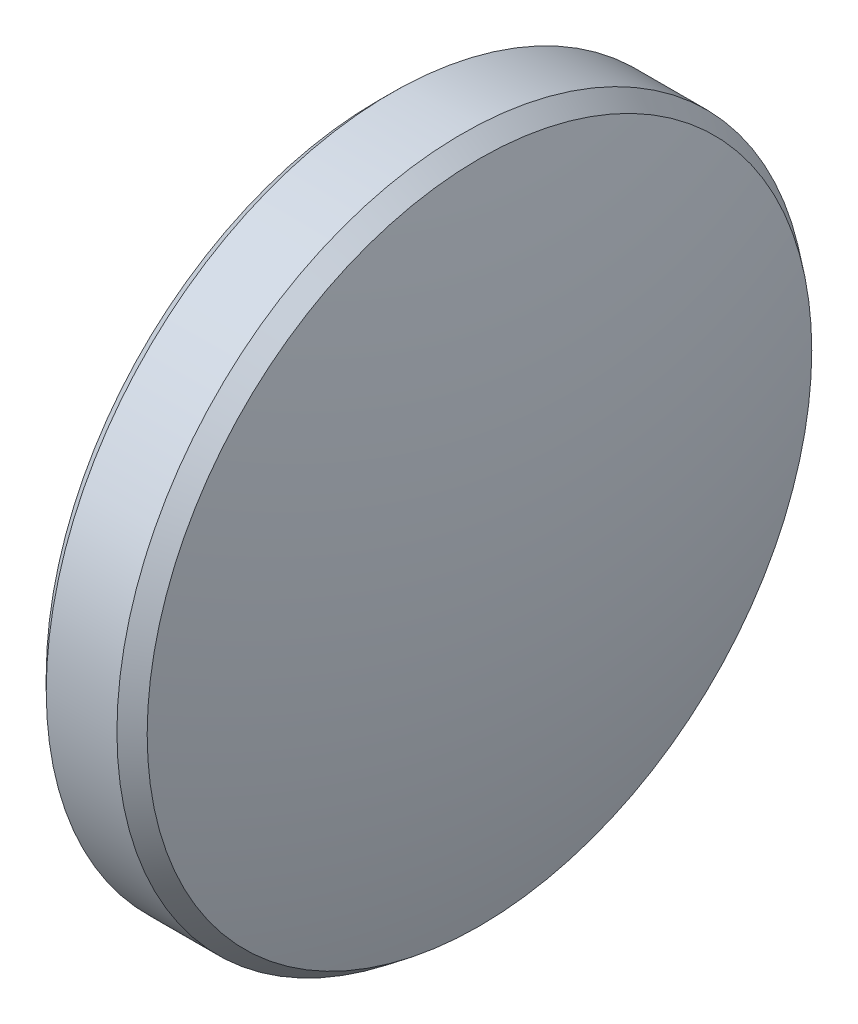
ISO-10303-21;
HEADER;
FILE_DESCRIPTION(('STEP AP214'),'2;1');
FILE_NAME('part.step','',(''),(''),'','','');
FILE_SCHEMA(('AUTOMOTIVE_DESIGN { 1 0 10303 214 1 1 1 1 }'));
ENDSEC;
DATA;
#1=APPLICATION_CONTEXT('core data for automotive mechanical design processes');
#2=APPLICATION_PROTOCOL_DEFINITION('international standard','automotive_design',2000,#1);
#3=PRODUCT_CONTEXT('',#1,'mechanical');
#4=PRODUCT('Part','Part','',(#3));
#5=PRODUCT_RELATED_PRODUCT_CATEGORY('part','',(#4));
#6=PRODUCT_DEFINITION_FORMATION('','',#4);
#7=PRODUCT_DEFINITION_CONTEXT('part definition',#1,'design');
#8=PRODUCT_DEFINITION('design','',#6,#7);
#9=PRODUCT_DEFINITION_SHAPE('','',#8);
#10=(LENGTH_UNIT() NAMED_UNIT(*) SI_UNIT(.MILLI.,.METRE.));
#11=(NAMED_UNIT(*) PLANE_ANGLE_UNIT() SI_UNIT($,.RADIAN.));
#12=(NAMED_UNIT(*) SI_UNIT($,.STERADIAN.) SOLID_ANGLE_UNIT());
#13=UNCERTAINTY_MEASURE_WITH_UNIT(LENGTH_MEASURE(1.E-05),#10,'distance_accuracy_value','');
#14=(GEOMETRIC_REPRESENTATION_CONTEXT(3) GLOBAL_UNCERTAINTY_ASSIGNED_CONTEXT((#13)) GLOBAL_UNIT_ASSIGNED_CONTEXT((#10,
#11,#12)) REPRESENTATION_CONTEXT('',''));
#15=CARTESIAN_POINT('',(0.,0.,0.));
#16=DIRECTION('',(0.,0.,1.));
#17=DIRECTION('',(1.,0.,0.));
#18=AXIS2_PLACEMENT_3D('',#15,#16,#17);
#19=CARTESIAN_POINT('',(-1.35,0.,0.));
#20=DIRECTION('',(1.,0.,0.));
#21=DIRECTION('',(0.,0.,-1.));
#22=AXIS2_PLACEMENT_3D('',#19,#20,#21);
#23=PLANE('',#22);
#24=CARTESIAN_POINT('',(-1.35,0.,0.));
#25=DIRECTION('',(1.,0.,0.));
#26=DIRECTION('',(0.,0.,-1.));
#27=AXIS2_PLACEMENT_3D('',#24,#25,#26);
#28=CIRCLE('',#27,6.1);
#29=CARTESIAN_POINT('',(-1.35,0.,-6.1));
#30=VERTEX_POINT('',#29);
#31=EDGE_CURVE('E10',#30,#30,#28,.F.);
#32=ORIENTED_EDGE('',*,*,#31,.T.);
#33=EDGE_LOOP('',(#32));
#34=FACE_BOUND('',#33,.T.);
#35=ADVANCED_FACE('F15',(#34),#23,.F.);
#36=CARTESIAN_POINT('',(-1.35,0.,0.));
#37=DIRECTION('',(-1.,0.,0.));
#38=DIRECTION('',(0.,0.,1.));
#39=AXIS2_PLACEMENT_3D('',#36,#37,#38);
#40=CYLINDRICAL_SURFACE('',#39,6.35);
#41=CARTESIAN_POINT('',(0.199999999999999,0.,0.));
#42=DIRECTION('',(-1.,0.,0.));
#43=DIRECTION('',(0.,0.,1.));
#44=AXIS2_PLACEMENT_3D('',#41,#42,#43);
#45=CIRCLE('',#44,6.35);
#46=CARTESIAN_POINT('',(0.199999999999999,0.,6.35));
#47=VERTEX_POINT('',#46);
#48=EDGE_CURVE('E55',#47,#47,#45,.T.);
#49=ORIENTED_EDGE('',*,*,#48,.T.);
#50=EDGE_LOOP('',(#49));
#51=FACE_BOUND('',#50,.T.);
#52=CARTESIAN_POINT('',(-1.1,0.,0.));
#53=DIRECTION('',(1.,0.,0.));
#54=DIRECTION('',(0.,0.,-1.));
#55=AXIS2_PLACEMENT_3D('',#52,#53,#54);
#56=CIRCLE('',#55,6.35);
#57=CARTESIAN_POINT('',(-1.1,0.,-6.35));
#58=VERTEX_POINT('',#57);
#59=EDGE_CURVE('E53',#58,#58,#56,.T.);
#60=ORIENTED_EDGE('',*,*,#59,.T.);
#61=EDGE_LOOP('',(#60));
#62=FACE_BOUND('',#61,.T.);
#63=ADVANCED_FACE('F28',(#51,#62),#40,.T.);
#64=CARTESIAN_POINT('',(-21.6499903566923,0.,-0.02106162535796));
#65=DIRECTION('',(0.,-1.,0.));
#66=DIRECTION('',(0.,0.,1.));
#67=AXIS2_PLACEMENT_3D('',#64,#65,#66);
#68=CIRCLE('',#67,23.);
#69=TRIMMED_CURVE('',#68,(PARAMETER_VALUE(-1.56988060382527)),
(PARAMETER_VALUE(1.56988060382527)),.T.,.PARAMETER.);
#70=CARTESIAN_POINT('',(-21.6499903566923,0.,0.));
#71=DIRECTION('',(-1.,0.,0.));
#72=AXIS1_PLACEMENT('',#70,#71);
#73=SURFACE_OF_REVOLUTION('',#69,#72);
#74=CARTESIAN_POINT('',(0.517470524714639,0.,0.));
#75=DIRECTION('',(-1.,0.,0.));
#76=DIRECTION('',(0.,0.,1.));
#77=AXIS2_PLACEMENT_3D('',#74,#75,#76);
#78=CIRCLE('',#77,6.11112216765532);
#79=CARTESIAN_POINT('',(0.517470524714639,0.,6.11112216765532));
#80=VERTEX_POINT('',#79);
#81=EDGE_CURVE('E22',#80,#80,#78,.F.);
#82=ORIENTED_EDGE('',*,*,#81,.T.);
#83=EDGE_LOOP('',(#82));
#84=FACE_BOUND('',#83,.T.);
#85=CARTESIAN_POINT('',(1.35,0.,0.));
#86=VERTEX_POINT('',#85);
#87=VERTEX_LOOP('',#86);
#88=FACE_BOUND('',#87,.T.);
#89=ADVANCED_FACE('F25',(#84,#88),#73,.T.);
#90=CARTESIAN_POINT('',(0.199999999999999,0.,0.));
#91=DIRECTION('',(-1.,0.,0.));
#92=DIRECTION('',(0.,0.,1.));
#93=AXIS2_PLACEMENT_3D('',#90,#91,#92);
#94=CONICAL_SURFACE('',#93,6.35,0.645061505663778);
#95=ORIENTED_EDGE('',*,*,#81,.F.);
#96=EDGE_LOOP('',(#95));
#97=FACE_BOUND('',#96,.T.);
#98=ORIENTED_EDGE('',*,*,#48,.F.);
#99=EDGE_LOOP('',(#98));
#100=FACE_BOUND('',#99,.T.);
#101=ADVANCED_FACE('F27',(#97,#100),#94,.T.);
#102=CARTESIAN_POINT('',(-1.35,0.,0.));
#103=DIRECTION('',(1.,0.,0.));
#104=DIRECTION('',(0.,0.,-1.));
#105=AXIS2_PLACEMENT_3D('',#102,#103,#104);
#106=CONICAL_SURFACE('',#105,6.1,0.785398163397443);
#107=ORIENTED_EDGE('',*,*,#59,.F.);
#108=EDGE_LOOP('',(#107));
#109=FACE_BOUND('',#108,.T.);
#110=ORIENTED_EDGE('',*,*,#31,.F.);
#111=EDGE_LOOP('',(#110));
#112=FACE_BOUND('',#111,.T.);
#113=ADVANCED_FACE('F17',(#109,#112),#106,.T.);
#114=CLOSED_SHELL('',(#35,#63,#89,#101,#113));
#115=MANIFOLD_SOLID_BREP('B1',#114);
#116=ADVANCED_BREP_SHAPE_REPRESENTATION('',(#18,#115),#14);
#117=SHAPE_DEFINITION_REPRESENTATION(#9,#116);
ENDSEC;
END-ISO-10303-21;
